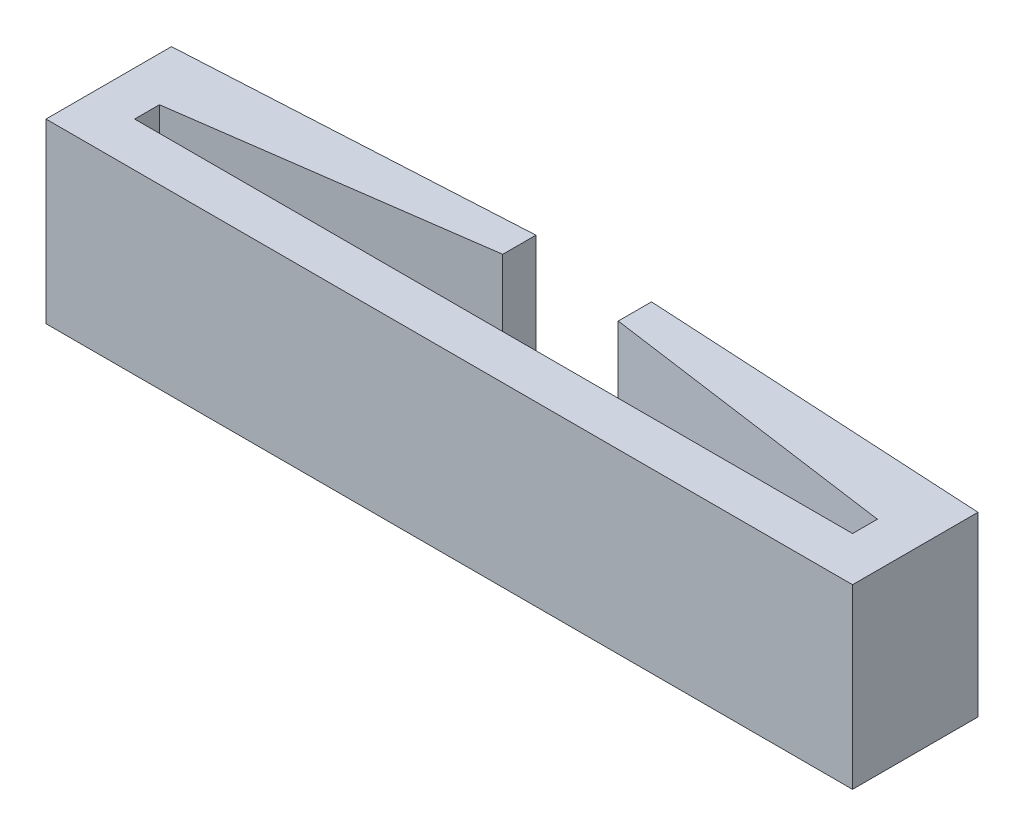
ISO-10303-21;
HEADER;
FILE_DESCRIPTION(('STEP AP214'),'2;1');
FILE_NAME('part.step','',(''),(''),'','','');
FILE_SCHEMA(('AUTOMOTIVE_DESIGN { 1 0 10303 214 1 1 1 1 }'));
ENDSEC;
DATA;
#1=APPLICATION_CONTEXT('core data for automotive mechanical design processes');
#2=APPLICATION_PROTOCOL_DEFINITION('international standard','automotive_design',2000,#1);
#3=PRODUCT_CONTEXT('',#1,'mechanical');
#4=PRODUCT('Part','Part','',(#3));
#5=PRODUCT_RELATED_PRODUCT_CATEGORY('part','',(#4));
#6=PRODUCT_DEFINITION_FORMATION('','',#4);
#7=PRODUCT_DEFINITION_CONTEXT('part definition',#1,'design');
#8=PRODUCT_DEFINITION('design','',#6,#7);
#9=PRODUCT_DEFINITION_SHAPE('','',#8);
#10=(LENGTH_UNIT() NAMED_UNIT(*) SI_UNIT(.MILLI.,.METRE.));
#11=(NAMED_UNIT(*) PLANE_ANGLE_UNIT() SI_UNIT($,.RADIAN.));
#12=(NAMED_UNIT(*) SI_UNIT($,.STERADIAN.) SOLID_ANGLE_UNIT());
#13=UNCERTAINTY_MEASURE_WITH_UNIT(LENGTH_MEASURE(1.E-05),#10,'distance_accuracy_value','');
#14=(GEOMETRIC_REPRESENTATION_CONTEXT(3) GLOBAL_UNCERTAINTY_ASSIGNED_CONTEXT((#13)) GLOBAL_UNIT_ASSIGNED_CONTEXT((#10,
#11,#12)) REPRESENTATION_CONTEXT('',''));
#15=CARTESIAN_POINT('',(0.,0.,0.));
#16=DIRECTION('',(0.,0.,1.));
#17=DIRECTION('',(1.,0.,0.));
#18=AXIS2_PLACEMENT_3D('',#15,#16,#17);
#19=CARTESIAN_POINT('',(40.4999999999978,-9.9999999713932,-5.46356580898595E-06));
#20=DIRECTION('',(-1.,0.,-1.95770992707561E-13));
#21=DIRECTION('',(-1.95770992707561E-13,0.,1.));
#22=AXIS2_PLACEMENT_3D('',#19,#20,#21);
#23=PLANE('',#22);
#24=CARTESIAN_POINT('',(40.4999999999978,28.6493442492265,-9.4580376516773E-13));
#25=DIRECTION('',(-1.,0.,-1.95770992707561E-13));
#26=DIRECTION('',(0.,-0.999847695156391,-0.0174524064372772));
#27=AXIS2_PLACEMENT_3D('',#24,#25,#26);
#28=ELLIPSE('',#27,28.6537070186987,0.5);
#29=CARTESIAN_POINT('',(40.4999999999978,8.38795720706216,-5.46356580898595E-06));
#30=VERTEX_POINT('',#29);
#31=CARTESIAN_POINT('',(40.4999999999978,2.53081651982366E-13,-0.499923847578205));
#32=VERTEX_POINT('',#31);
#33=EDGE_CURVE('E252',#30,#32,#28,.F.);
#34=ORIENTED_EDGE('',*,*,#33,.F.);
#35=DIRECTION('',(0.,1.,0.));
#36=VECTOR('',#35,1.);
#37=CARTESIAN_POINT('',(40.4999999999978,-9.9999999713932,-5.46356580898595E-06));
#38=LINE('',#37,#36);
#39=CARTESIAN_POINT('',(40.4999999999978,10.,-5.46356580898595E-06));
#40=VERTEX_POINT('',#39);
#41=EDGE_CURVE('E136',#30,#40,#38,.T.);
#42=ORIENTED_EDGE('',*,*,#41,.T.);
#43=DIRECTION('',(-1.95770992707561E-13,0.,1.));
#44=VECTOR('',#43,1.);
#45=CARTESIAN_POINT('',(40.4999999999978,10.,-5.46356580898595E-06));
#46=LINE('',#45,#44);
#47=CARTESIAN_POINT('',(40.4999999999983,10.,-2.80007615242175));
#48=VERTEX_POINT('',#47);
#49=EDGE_CURVE('E184',#48,#40,#46,.T.);
#50=ORIENTED_EDGE('',*,*,#49,.F.);
#51=DIRECTION('',(0.,1.,0.));
#52=VECTOR('',#51,1.);
#53=CARTESIAN_POINT('',(40.4999999999983,-9.9999999713932,-2.80007615242175));
#54=LINE('',#53,#52);
#55=CARTESIAN_POINT('',(40.4999999999983,-9.9999999713932,-2.80007615242175));
#56=VERTEX_POINT('',#55);
#57=EDGE_CURVE('E150',#56,#48,#54,.T.);
#58=ORIENTED_EDGE('',*,*,#57,.F.);
#59=DIRECTION('',(-1.95770992707561E-13,0.,1.));
#60=VECTOR('',#59,1.);
#61=CARTESIAN_POINT('',(40.4999999999978,-9.9999999713932,-5.46356580898595E-06));
#62=LINE('',#61,#60);
#63=CARTESIAN_POINT('',(40.4999999999978,-9.9999999713932,-5.46356580898595E-06));
#64=VERTEX_POINT('',#63);
#65=EDGE_CURVE('E143',#56,#64,#62,.T.);
#66=ORIENTED_EDGE('',*,*,#65,.T.);
#67=CARTESIAN_POINT('',(40.4999999999978,-8.38795720706217,-5.46356580898595E-06));
#68=VERTEX_POINT('',#67);
#69=EDGE_CURVE('E127',#64,#68,#38,.T.);
#70=ORIENTED_EDGE('',*,*,#69,.T.);
#71=CARTESIAN_POINT('',(40.4999999999978,-28.6493442492265,-9.4580376516773E-13));
#72=DIRECTION('',(-1.,0.,-1.95770992707561E-13));
#73=DIRECTION('',(0.,-0.999847695156391,0.0174524064372772));
#74=AXIS2_PLACEMENT_3D('',#71,#72,#73);
#75=ELLIPSE('',#74,28.6537070186987,0.5);
#76=EDGE_CURVE('E250',#32,#68,#75,.F.);
#77=ORIENTED_EDGE('',*,*,#76,.F.);
#78=EDGE_LOOP('',(#34,#42,#50,#58,#66,#70,#77));
#79=FACE_BOUND('',#78,.T.);
#80=ADVANCED_FACE('F16',(#79),#23,.T.);
#81=CARTESIAN_POINT('',(-40.4999999999978,-9.9999999713932,-2.800076152422));
#82=DIRECTION('',(1.,0.,1.98248717309288E-13));
#83=DIRECTION('',(1.98248717309288E-13,0.,-1.));
#84=AXIS2_PLACEMENT_3D('',#81,#82,#83);
#85=PLANE('',#84);
#86=CARTESIAN_POINT('',(-40.4999999999984,28.6493442492639,-2.9354773820045E-13));
#87=DIRECTION('',(1.,0.,1.98248717309288E-13));
#88=DIRECTION('',(0.,-0.999847695156391,-0.0174524064372841));
#89=AXIS2_PLACEMENT_3D('',#86,#87,#88);
#90=ELLIPSE('',#89,28.65370701871,0.5);
#91=CARTESIAN_POINT('',(-40.4999999999983,-2.58313986502162E-11,-0.499923847578205));
#92=VERTEX_POINT('',#91);
#93=CARTESIAN_POINT('',(-40.4999999999984,8.38811468213971,3.39300519291982E-08));
#94=VERTEX_POINT('',#93);
#95=EDGE_CURVE('E239',#92,#94,#90,.F.);
#96=ORIENTED_EDGE('',*,*,#95,.F.);
#97=CARTESIAN_POINT('',(-40.4999999999984,-28.6493442492639,-2.9354773820045E-13));
#98=DIRECTION('',(1.,0.,1.98248717309288E-13));
#99=DIRECTION('',(0.,-0.999847695156391,0.0174524064372841));
#100=AXIS2_PLACEMENT_3D('',#97,#98,#99);
#101=ELLIPSE('',#100,28.65370701871,0.5);
#102=CARTESIAN_POINT('',(-40.4999999999984,-8.38811468213971,3.39300519291982E-08));
#103=VERTEX_POINT('',#102);
#104=EDGE_CURVE('E217',#103,#92,#101,.F.);
#105=ORIENTED_EDGE('',*,*,#104,.F.);
#106=DIRECTION('',(0.,1.,0.));
#107=VECTOR('',#106,1.);
#108=CARTESIAN_POINT('',(-40.4999999999984,-9.9999999713932,3.39300519291982E-08));
#109=LINE('',#108,#107);
#110=CARTESIAN_POINT('',(-40.4999999999984,-9.9999999713932,3.39300519291982E-08));
#111=VERTEX_POINT('',#110);
#112=EDGE_CURVE('E38',#111,#103,#109,.T.);
#113=ORIENTED_EDGE('',*,*,#112,.F.);
#114=DIRECTION('',(1.98248717309288E-13,0.,-1.));
#115=VECTOR('',#114,1.);
#116=CARTESIAN_POINT('',(-40.4999999999978,-9.9999999713932,-2.800076152422));
#117=LINE('',#116,#115);
#118=CARTESIAN_POINT('',(-40.4999999999978,-9.9999999713932,-2.800076152422));
#119=VERTEX_POINT('',#118);
#120=EDGE_CURVE('E147',#111,#119,#117,.T.);
#121=ORIENTED_EDGE('',*,*,#120,.T.);
#122=DIRECTION('',(0.,1.,0.));
#123=VECTOR('',#122,1.);
#124=CARTESIAN_POINT('',(-40.4999999999978,-9.9999999713932,-2.800076152422));
#125=LINE('',#124,#123);
#126=CARTESIAN_POINT('',(-40.4999999999978,10.,-2.800076152422));
#127=VERTEX_POINT('',#126);
#128=EDGE_CURVE('E234',#119,#127,#125,.T.);
#129=ORIENTED_EDGE('',*,*,#128,.T.);
#130=DIRECTION('',(1.98248717309288E-13,0.,-1.));
#131=VECTOR('',#130,1.);
#132=CARTESIAN_POINT('',(-40.4999999999978,10.,-2.800076152422));
#133=LINE('',#132,#131);
#134=CARTESIAN_POINT('',(-40.4999999999984,10.,3.39300519291982E-08));
#135=VERTEX_POINT('',#134);
#136=EDGE_CURVE('E190',#135,#127,#133,.T.);
#137=ORIENTED_EDGE('',*,*,#136,.F.);
#138=EDGE_CURVE('E135',#94,#135,#109,.T.);
#139=ORIENTED_EDGE('',*,*,#138,.F.);
#140=EDGE_LOOP('',(#96,#105,#113,#121,#129,#137,#139));
#141=FACE_BOUND('',#140,.T.);
#142=ADVANCED_FACE('F298',(#141),#85,.T.);
#143=CARTESIAN_POINT('',(40.4999999999983,-9.9999999713932,-2.80007615242175));
#144=DIRECTION('',(-0.138376222382661,0.,0.990379735797893));
#145=DIRECTION('',(0.990379735797893,0.,0.138376222382661));
#146=AXIS2_PLACEMENT_3D('',#143,#144,#145);
#147=PLANE('',#146);
#148=DIRECTION('',(0.990379735797893,0.,0.138376222382661));
#149=VECTOR('',#148,1.);
#150=CARTESIAN_POINT('',(40.4999999999983,10.,-2.80007615242175));
#151=LINE('',#150,#149);
#152=CARTESIAN_POINT('',(6.51680452782488,10.,-7.5482207720634));
#153=VERTEX_POINT('',#152);
#154=EDGE_CURVE('E151',#153,#48,#151,.T.);
#155=ORIENTED_EDGE('',*,*,#154,.F.);
#156=DIRECTION('',(0.,1.,0.));
#157=VECTOR('',#156,1.);
#158=CARTESIAN_POINT('',(6.51680452782488,-9.9999999713932,-7.5482207720634));
#159=LINE('',#158,#157);
#160=CARTESIAN_POINT('',(6.51680452782488,-9.9999999713932,-7.5482207720634));
#161=VERTEX_POINT('',#160);
#162=EDGE_CURVE('E218',#161,#153,#159,.T.);
#163=ORIENTED_EDGE('',*,*,#162,.F.);
#164=DIRECTION('',(0.990379735797893,0.,0.138376222382661));
#165=VECTOR('',#164,1.);
#166=CARTESIAN_POINT('',(40.4999999999983,-9.9999999713932,-2.80007615242175));
#167=LINE('',#166,#165);
#168=EDGE_CURVE('E182',#161,#56,#167,.T.);
#169=ORIENTED_EDGE('',*,*,#168,.T.);
#170=ORIENTED_EDGE('',*,*,#57,.T.);
#171=EDGE_LOOP('',(#155,#163,#169,#170));
#172=FACE_BOUND('',#171,.T.);
#173=ADVANCED_FACE('F267',(#172),#147,.T.);
#174=CARTESIAN_POINT('',(6.51680452782488,-9.9999999713932,-7.5482207720634));
#175=DIRECTION('',(-1.,0.,0.));
#176=DIRECTION('',(0.,0.,1.));
#177=AXIS2_PLACEMENT_3D('',#174,#175,#176);
#178=PLANE('',#177);
#179=DIRECTION('',(0.,0.,1.));
#180=VECTOR('',#179,1.);
#181=CARTESIAN_POINT('',(6.51680452782488,10.,-7.5482207720634));
#182=LINE('',#181,#180);
#183=CARTESIAN_POINT('',(6.51680452782488,10.,-11.2970748564441));
#184=VERTEX_POINT('',#183);
#185=EDGE_CURVE('E154',#184,#153,#182,.T.);
#186=ORIENTED_EDGE('',*,*,#185,.F.);
#187=DIRECTION('',(0.,1.,0.));
#188=VECTOR('',#187,1.);
#189=CARTESIAN_POINT('',(6.51680452782488,-9.9999999713932,-11.2970748564441));
#190=LINE('',#189,#188);
#191=CARTESIAN_POINT('',(6.51680452782488,-9.9999999713932,-11.2970748564441));
#192=VERTEX_POINT('',#191);
#193=EDGE_CURVE('E220',#192,#184,#190,.T.);
#194=ORIENTED_EDGE('',*,*,#193,.F.);
#195=DIRECTION('',(0.,0.,1.));
#196=VECTOR('',#195,1.);
#197=CARTESIAN_POINT('',(6.51680452782488,-9.9999999713932,-7.5482207720634));
#198=LINE('',#197,#196);
#199=EDGE_CURVE('E179',#192,#161,#198,.T.);
#200=ORIENTED_EDGE('',*,*,#199,.T.);
#201=ORIENTED_EDGE('',*,*,#162,.T.);
#202=EDGE_LOOP('',(#186,#194,#200,#201));
#203=FACE_BOUND('',#202,.T.);
#204=ADVANCED_FACE('F431',(#203),#178,.T.);
#205=CARTESIAN_POINT('',(6.51680452782488,-9.9999999713932,-11.2970748564441));
#206=DIRECTION('',(0.0548674959499856,0.,-0.998493644390478));
#207=DIRECTION('',(-0.998493644390478,0.,-0.0548674959499857));
#208=AXIS2_PLACEMENT_3D('',#205,#206,#207);
#209=PLANE('',#208);
#210=DIRECTION('',(-0.998493644390478,0.,-0.0548674959499856));
#211=VECTOR('',#210,1.);
#212=CARTESIAN_POINT('',(6.51680452782488,10.,-11.2970748564441));
#213=LINE('',#212,#211);
#214=CARTESIAN_POINT('',(45.5000000000027,10.,-9.15493771645967));
#215=VERTEX_POINT('',#214);
#216=EDGE_CURVE('E211',#215,#184,#213,.T.);
#217=ORIENTED_EDGE('',*,*,#216,.F.);
#218=DIRECTION('',(0.,1.,0.));
#219=VECTOR('',#218,1.);
#220=CARTESIAN_POINT('',(45.5000000000027,-9.9999999713932,-9.15493771645967));
#221=LINE('',#220,#219);
#222=CARTESIAN_POINT('',(45.5000000000027,-9.9999999713932,-9.15493771645967));
#223=VERTEX_POINT('',#222);
#224=EDGE_CURVE('E222',#223,#215,#221,.T.);
#225=ORIENTED_EDGE('',*,*,#224,.F.);
#226=DIRECTION('',(-0.998493644390478,0.,-0.0548674959499856));
#227=VECTOR('',#226,1.);
#228=CARTESIAN_POINT('',(6.51680452782488,-9.9999999713932,-11.2970748564441));
#229=LINE('',#228,#227);
#230=EDGE_CURVE('E176',#223,#192,#229,.T.);
#231=ORIENTED_EDGE('',*,*,#230,.T.);
#232=ORIENTED_EDGE('',*,*,#193,.T.);
#233=EDGE_LOOP('',(#217,#225,#231,#232));
#234=FACE_BOUND('',#233,.T.);
#235=ADVANCED_FACE('F274',(#234),#209,.T.);
#236=CARTESIAN_POINT('',(45.5000000000027,-9.9999999713932,-9.15493771645967));
#237=DIRECTION('',(1.,0.,0.));
#238=DIRECTION('',(0.,0.,-1.));
#239=AXIS2_PLACEMENT_3D('',#236,#237,#238);
#240=PLANE('',#239);
#241=DIRECTION('',(0.,0.,-1.));
#242=VECTOR('',#241,1.);
#243=CARTESIAN_POINT('',(45.5000000000027,10.,-9.15493771645967));
#244=LINE('',#243,#242);
#245=CARTESIAN_POINT('',(45.5000000000028,10.,5.));
#246=VERTEX_POINT('',#245);
#247=EDGE_CURVE('E208',#246,#215,#244,.T.);
#248=ORIENTED_EDGE('',*,*,#247,.F.);
#249=DIRECTION('',(0.,1.,0.));
#250=VECTOR('',#249,1.);
#251=CARTESIAN_POINT('',(45.5000000000028,-9.9999999713932,5.));
#252=LINE('',#251,#250);
#253=CARTESIAN_POINT('',(45.5000000000028,-9.9999999713932,5.));
#254=VERTEX_POINT('',#253);
#255=EDGE_CURVE('E224',#254,#246,#252,.T.);
#256=ORIENTED_EDGE('',*,*,#255,.F.);
#257=DIRECTION('',(0.,0.,-1.));
#258=VECTOR('',#257,1.);
#259=CARTESIAN_POINT('',(45.5000000000027,-9.9999999713932,-9.15493771645967));
#260=LINE('',#259,#258);
#261=EDGE_CURVE('E173',#254,#223,#260,.T.);
#262=ORIENTED_EDGE('',*,*,#261,.T.);
#263=ORIENTED_EDGE('',*,*,#224,.T.);
#264=EDGE_LOOP('',(#248,#256,#262,#263));
#265=FACE_BOUND('',#264,.T.);
#266=ADVANCED_FACE('F277',(#265),#240,.T.);
#267=CARTESIAN_POINT('',(45.5000000000028,-9.9999999713932,5.));
#268=DIRECTION('',(0.,0.,1.));
#269=DIRECTION('',(1.,0.,0.));
#270=AXIS2_PLACEMENT_3D('',#267,#268,#269);
#271=PLANE('',#270);
#272=DIRECTION('',(1.,0.,0.));
#273=VECTOR('',#272,1.);
#274=CARTESIAN_POINT('',(45.5000000000028,10.,5.));
#275=LINE('',#274,#273);
#276=CARTESIAN_POINT('',(-45.5000000000031,10.,5.));
#277=VERTEX_POINT('',#276);
#278=EDGE_CURVE('E205',#277,#246,#275,.T.);
#279=ORIENTED_EDGE('',*,*,#278,.F.);
#280=DIRECTION('',(0.,1.,0.));
#281=VECTOR('',#280,1.);
#282=CARTESIAN_POINT('',(-45.5000000000031,-9.9999999713932,5.));
#283=LINE('',#282,#281);
#284=CARTESIAN_POINT('',(-45.5000000000031,-9.9999999713932,5.));
#285=VERTEX_POINT('',#284);
#286=EDGE_CURVE('E226',#285,#277,#283,.T.);
#287=ORIENTED_EDGE('',*,*,#286,.F.);
#288=DIRECTION('',(1.,0.,0.));
#289=VECTOR('',#288,1.);
#290=CARTESIAN_POINT('',(45.5000000000028,-9.9999999713932,5.));
#291=LINE('',#290,#289);
#292=EDGE_CURVE('E170',#285,#254,#291,.T.);
#293=ORIENTED_EDGE('',*,*,#292,.T.);
#294=ORIENTED_EDGE('',*,*,#255,.T.);
#295=EDGE_LOOP('',(#279,#287,#293,#294));
#296=FACE_BOUND('',#295,.T.);
#297=ADVANCED_FACE('F282',(#296),#271,.T.);
#298=CARTESIAN_POINT('',(-45.5000000000031,-9.9999999713932,5.));
#299=DIRECTION('',(-1.,0.,0.));
#300=DIRECTION('',(0.,0.,1.));
#301=AXIS2_PLACEMENT_3D('',#298,#299,#300);
#302=PLANE('',#301);
#303=DIRECTION('',(0.,0.,1.));
#304=VECTOR('',#303,1.);
#305=CARTESIAN_POINT('',(-45.5000000000031,10.,5.));
#306=LINE('',#305,#304);
#307=CARTESIAN_POINT('',(-45.5000000000022,10.,-9.1549377164597));
#308=VERTEX_POINT('',#307);
#309=EDGE_CURVE('E202',#308,#277,#306,.T.);
#310=ORIENTED_EDGE('',*,*,#309,.F.);
#311=DIRECTION('',(0.,1.,0.));
#312=VECTOR('',#311,1.);
#313=CARTESIAN_POINT('',(-45.5000000000022,-9.9999999713932,-9.1549377164597));
#314=LINE('',#313,#312);
#315=CARTESIAN_POINT('',(-45.5000000000022,-9.9999999713932,-9.1549377164597));
#316=VERTEX_POINT('',#315);
#317=EDGE_CURVE('E228',#316,#308,#314,.T.);
#318=ORIENTED_EDGE('',*,*,#317,.F.);
#319=DIRECTION('',(0.,0.,1.));
#320=VECTOR('',#319,1.);
#321=CARTESIAN_POINT('',(-45.5000000000031,-9.9999999713932,5.));
#322=LINE('',#321,#320);
#323=EDGE_CURVE('E167',#316,#285,#322,.T.);
#324=ORIENTED_EDGE('',*,*,#323,.T.);
#325=ORIENTED_EDGE('',*,*,#286,.T.);
#326=EDGE_LOOP('',(#310,#318,#324,#325));
#327=FACE_BOUND('',#326,.T.);
#328=ADVANCED_FACE('F285',(#327),#302,.T.);
#329=CARTESIAN_POINT('',(-6.51680452782488,-9.9999999713932,-11.2970748564441));
#330=DIRECTION('',(-0.0548674959499857,0.,-0.998493644390478));
#331=DIRECTION('',(-0.998493644390478,0.,0.0548674959499857));
#332=AXIS2_PLACEMENT_3D('',#329,#330,#331);
#333=PLANE('',#332);
#334=DIRECTION('',(-0.998493644390478,0.,0.0548674959499857));
#335=VECTOR('',#334,1.);
#336=CARTESIAN_POINT('',(-6.51680452782488,10.,-11.2970748564441));
#337=LINE('',#336,#335);
#338=CARTESIAN_POINT('',(-6.51680452782488,10.,-11.2970748564441));
#339=VERTEX_POINT('',#338);
#340=EDGE_CURVE('E199',#339,#308,#337,.T.);
#341=ORIENTED_EDGE('',*,*,#340,.F.);
#342=DIRECTION('',(0.,1.,0.));
#343=VECTOR('',#342,1.);
#344=CARTESIAN_POINT('',(-6.51680452782488,-9.9999999713932,-11.2970748564441));
#345=LINE('',#344,#343);
#346=CARTESIAN_POINT('',(-6.51680452782488,-9.9999999713932,-11.2970748564441));
#347=VERTEX_POINT('',#346);
#348=EDGE_CURVE('E230',#347,#339,#345,.T.);
#349=ORIENTED_EDGE('',*,*,#348,.F.);
#350=DIRECTION('',(-0.998493644390478,0.,0.0548674959499857));
#351=VECTOR('',#350,1.);
#352=CARTESIAN_POINT('',(-6.51680452782488,-9.9999999713932,-11.2970748564441));
#353=LINE('',#352,#351);
#354=EDGE_CURVE('E164',#347,#316,#353,.T.);
#355=ORIENTED_EDGE('',*,*,#354,.T.);
#356=ORIENTED_EDGE('',*,*,#317,.T.);
#357=EDGE_LOOP('',(#341,#349,#355,#356));
#358=FACE_BOUND('',#357,.T.);
#359=ADVANCED_FACE('F290',(#358),#333,.T.);
#360=CARTESIAN_POINT('',(-6.51680452782488,-9.9999999713932,-7.5482207720634));
#361=DIRECTION('',(1.,0.,0.));
#362=DIRECTION('',(0.,0.,-1.));
#363=AXIS2_PLACEMENT_3D('',#360,#361,#362);
#364=PLANE('',#363);
#365=DIRECTION('',(0.,0.,-1.));
#366=VECTOR('',#365,1.);
#367=CARTESIAN_POINT('',(-6.51680452782488,10.,-7.5482207720634));
#368=LINE('',#367,#366);
#369=CARTESIAN_POINT('',(-6.51680452782488,10.,-7.5482207720634));
#370=VERTEX_POINT('',#369);
#371=EDGE_CURVE('E196',#370,#339,#368,.T.);
#372=ORIENTED_EDGE('',*,*,#371,.F.);
#373=DIRECTION('',(0.,1.,0.));
#374=VECTOR('',#373,1.);
#375=CARTESIAN_POINT('',(-6.51680452782488,-9.9999999713932,-7.5482207720634));
#376=LINE('',#375,#374);
#377=CARTESIAN_POINT('',(-6.51680452782488,-9.9999999713932,-7.5482207720634));
#378=VERTEX_POINT('',#377);
#379=EDGE_CURVE('E232',#378,#370,#376,.T.);
#380=ORIENTED_EDGE('',*,*,#379,.F.);
#381=DIRECTION('',(0.,0.,-1.));
#382=VECTOR('',#381,1.);
#383=CARTESIAN_POINT('',(-6.51680452782488,-9.9999999713932,-7.5482207720634));
#384=LINE('',#383,#382);
#385=EDGE_CURVE('E161',#378,#347,#384,.T.);
#386=ORIENTED_EDGE('',*,*,#385,.T.);
#387=ORIENTED_EDGE('',*,*,#348,.T.);
#388=EDGE_LOOP('',(#372,#380,#386,#387));
#389=FACE_BOUND('',#388,.T.);
#390=ADVANCED_FACE('F293',(#389),#364,.T.);
#391=CARTESIAN_POINT('',(-40.4999999999978,-9.9999999713932,-2.800076152422));
#392=DIRECTION('',(0.138376222382655,0.,0.990379735797894));
#393=DIRECTION('',(0.990379735797894,0.,-0.138376222382655));
#394=AXIS2_PLACEMENT_3D('',#391,#392,#393);
#395=PLANE('',#394);
#396=DIRECTION('',(0.990379735797894,0.,-0.138376222382655));
#397=VECTOR('',#396,1.);
#398=CARTESIAN_POINT('',(-40.4999999999978,10.,-2.800076152422));
#399=LINE('',#398,#397);
#400=EDGE_CURVE('E193',#127,#370,#399,.T.);
#401=ORIENTED_EDGE('',*,*,#400,.F.);
#402=ORIENTED_EDGE('',*,*,#128,.F.);
#403=DIRECTION('',(0.990379735797894,0.,-0.138376222382655));
#404=VECTOR('',#403,1.);
#405=CARTESIAN_POINT('',(-40.4999999999978,-9.9999999713932,-2.800076152422));
#406=LINE('',#405,#404);
#407=EDGE_CURVE('E158',#119,#378,#406,.T.);
#408=ORIENTED_EDGE('',*,*,#407,.T.);
#409=ORIENTED_EDGE('',*,*,#379,.T.);
#410=EDGE_LOOP('',(#401,#402,#408,#409));
#411=FACE_BOUND('',#410,.T.);
#412=ADVANCED_FACE('F296',(#411),#395,.T.);
#413=CARTESIAN_POINT('',(0.,-10.,0.));
#414=DIRECTION('',(0.,1.,0.));
#415=DIRECTION('',(0.,0.,1.));
#416=AXIS2_PLACEMENT_3D('',#413,#414,#415);
#417=PLANE('',#416);
#418=ORIENTED_EDGE('',*,*,#65,.F.);
#419=ORIENTED_EDGE('',*,*,#168,.F.);
#420=ORIENTED_EDGE('',*,*,#199,.F.);
#421=ORIENTED_EDGE('',*,*,#230,.F.);
#422=ORIENTED_EDGE('',*,*,#261,.F.);
#423=ORIENTED_EDGE('',*,*,#292,.F.);
#424=ORIENTED_EDGE('',*,*,#323,.F.);
#425=ORIENTED_EDGE('',*,*,#354,.F.);
#426=ORIENTED_EDGE('',*,*,#385,.F.);
#427=ORIENTED_EDGE('',*,*,#407,.F.);
#428=ORIENTED_EDGE('',*,*,#120,.F.);
#429=DIRECTION('',(-1.,0.,6.78703192705605E-08));
#430=VECTOR('',#429,1.);
#431=CARTESIAN_POINT('',(-40.4999999999984,-9.9999999713932,3.39300519291982E-08));
#432=LINE('',#431,#430);
#433=EDGE_CURVE('E130',#64,#111,#432,.T.);
#434=ORIENTED_EDGE('',*,*,#433,.F.);
#435=EDGE_LOOP('',(#418,#419,#420,#421,#422,#423,#424,#425,#426,#427,#428,#434));
#436=FACE_BOUND('',#435,.T.);
#437=ADVANCED_FACE('F141',(#436),#417,.F.);
#438=CARTESIAN_POINT('',(0.,10.,0.));
#439=DIRECTION('',(0.,1.,0.));
#440=DIRECTION('',(0.,0.,1.));
#441=AXIS2_PLACEMENT_3D('',#438,#439,#440);
#442=PLANE('',#441);
#443=ORIENTED_EDGE('',*,*,#49,.T.);
#444=DIRECTION('',(-1.,0.,6.78703192705605E-08));
#445=VECTOR('',#444,1.);
#446=CARTESIAN_POINT('',(-40.4999999999984,10.,3.39300519291982E-08));
#447=LINE('',#446,#445);
#448=EDGE_CURVE('E187',#40,#135,#447,.T.);
#449=ORIENTED_EDGE('',*,*,#448,.T.);
#450=ORIENTED_EDGE('',*,*,#136,.T.);
#451=ORIENTED_EDGE('',*,*,#400,.T.);
#452=ORIENTED_EDGE('',*,*,#371,.T.);
#453=ORIENTED_EDGE('',*,*,#340,.T.);
#454=ORIENTED_EDGE('',*,*,#309,.T.);
#455=ORIENTED_EDGE('',*,*,#278,.T.);
#456=ORIENTED_EDGE('',*,*,#247,.T.);
#457=ORIENTED_EDGE('',*,*,#216,.T.);
#458=ORIENTED_EDGE('',*,*,#185,.T.);
#459=ORIENTED_EDGE('',*,*,#154,.T.);
#460=EDGE_LOOP('',(#443,#449,#450,#451,#452,#453,#454,#455,#456,#457,#458,#459));
#461=FACE_BOUND('',#460,.T.);
#462=ADVANCED_FACE('F263',(#461),#442,.T.);
#463=CARTESIAN_POINT('',(-40.1773549408,-10.16502118743,-0.3226450591987));
#464=DIRECTION('',(-0.0174497491606798,-0.999695459881888,0.0174497491606798));
#465=DIRECTION('',(0.,-0.0174524064372806,-0.999847695156391));
#466=AXIS2_PLACEMENT_3D('',#463,#464,#465);
#467=CYLINDRICAL_SURFACE('',#466,0.5);
#468=CARTESIAN_POINT('',(-40.5000000339287,-28.6493461931322,3.39300542957083E-08));
#469=DIRECTION('',(-6.78703192705605E-08,0.,-1.));
#470=DIRECTION('',(-0.0174524076214201,-0.999847695135722,1.18450047730575E-09));
#471=AXIS2_PLACEMENT_3D('',#468,#469,#470);
#472=ELLIPSE('',#471,28.6537089634407,0.5);
#473=CARTESIAN_POINT('',(-40.00007615242,0.,0.));
#474=VERTEX_POINT('',#473);
#475=EDGE_CURVE('E242',#474,#103,#472,.F.);
#476=ORIENTED_EDGE('',*,*,#475,.T.);
#477=ORIENTED_EDGE('',*,*,#104,.T.);
#478=CARTESIAN_POINT('',(-39.9999238359767,-1.5178830414797E-12,-0.500076164021969));
#479=DIRECTION('',(0.,-1.,0.));
#480=DIRECTION('',(0.707106781186548,0.,-0.707106781186548));
#481=AXIS2_PLACEMENT_3D('',#478,#479,#480);
#482=ELLIPSE('',#481,0.500152316445525,0.5);
#483=EDGE_CURVE('E11',#474,#92,#482,.T.);
#484=ORIENTED_EDGE('',*,*,#483,.F.);
#485=EDGE_LOOP('',(#476,#477,#484));
#486=FACE_BOUND('',#485,.T.);
#487=ADVANCED_FACE('F301',(#486),#467,.F.);
#488=CARTESIAN_POINT('',(-40.1773549408,10.16502118743,-0.3226450591987));
#489=DIRECTION('',(0.0174497491606798,-0.999695459881888,-0.0174497491606798));
#490=DIRECTION('',(0.,0.0174524064372806,-0.999847695156391));
#491=AXIS2_PLACEMENT_3D('',#488,#489,#490);
#492=CYLINDRICAL_SURFACE('',#491,0.5);
#493=ORIENTED_EDGE('',*,*,#483,.T.);
#494=ORIENTED_EDGE('',*,*,#95,.T.);
#495=CARTESIAN_POINT('',(-40.5000000339287,28.6493461931322,3.39300542957083E-08));
#496=DIRECTION('',(-6.78703192705605E-08,0.,-1.));
#497=DIRECTION('',(0.0174524076214201,-0.999847695135722,-1.18450047730575E-09));
#498=AXIS2_PLACEMENT_3D('',#495,#496,#497);
#499=ELLIPSE('',#498,28.6537089634407,0.5);
#500=EDGE_CURVE('E245',#94,#474,#499,.F.);
#501=ORIENTED_EDGE('',*,*,#500,.T.);
#502=EDGE_LOOP('',(#493,#494,#501));
#503=FACE_BOUND('',#502,.T.);
#504=ADVANCED_FACE('F303',(#503),#492,.F.);
#505=CARTESIAN_POINT('',(40.1773549408,-10.16502118743,-0.3226450591987));
#506=DIRECTION('',(0.0174497491606798,-0.999695459881888,0.0174497491606798));
#507=DIRECTION('',(0.,-0.0174524064372806,-0.999847695156391));
#508=AXIS2_PLACEMENT_3D('',#505,#506,#507);
#509=CYLINDRICAL_SURFACE('',#508,0.5);
#510=CARTESIAN_POINT('',(39.9999238359767,-1.5178830414797E-12,-0.500076164021969));
#511=DIRECTION('',(0.,-1.,0.));
#512=DIRECTION('',(-0.707106781186548,0.,-0.707106781186548));
#513=AXIS2_PLACEMENT_3D('',#510,#511,#512);
#514=ELLIPSE('',#513,0.500152316445525,0.5);
#515=CARTESIAN_POINT('',(40.0024065136359,-1.51506825835175E-12,-5.4297939803722E-06));
#516=VERTEX_POINT('',#515);
#517=EDGE_CURVE('E20',#32,#516,#514,.T.);
#518=ORIENTED_EDGE('',*,*,#517,.F.);
#519=ORIENTED_EDGE('',*,*,#76,.T.);
#520=CARTESIAN_POINT('',(40.4999945364332,-28.6490312418264,-5.46356543823035E-06));
#521=DIRECTION('',(-6.78703192705605E-08,0.,-1.));
#522=DIRECTION('',(0.0174524052531409,-0.999847695177061,-1.18450031656988E-09));
#523=AXIS2_PLACEMENT_3D('',#520,#521,#522);
#524=ELLIPSE('',#523,28.6537050739683,0.5);
#525=EDGE_CURVE('E131',#68,#516,#524,.F.);
#526=ORIENTED_EDGE('',*,*,#525,.T.);
#527=EDGE_LOOP('',(#518,#519,#526));
#528=FACE_BOUND('',#527,.T.);
#529=ADVANCED_FACE('F258',(#528),#509,.F.);
#530=CARTESIAN_POINT('',(40.1773549408,10.16502118743,-0.3226450591987));
#531=DIRECTION('',(-0.0174497491606798,-0.999695459881888,-0.0174497491606798));
#532=DIRECTION('',(0.,0.0174524064372806,-0.999847695156391));
#533=AXIS2_PLACEMENT_3D('',#530,#531,#532);
#534=CYLINDRICAL_SURFACE('',#533,0.5);
#535=CARTESIAN_POINT('',(40.4999945364332,28.6490312418264,-5.46356543823035E-06));
#536=DIRECTION('',(-6.78703192705605E-08,0.,-1.));
#537=DIRECTION('',(-0.0174524052531409,-0.999847695177061,1.18450031656988E-09));
#538=AXIS2_PLACEMENT_3D('',#535,#536,#537);
#539=ELLIPSE('',#538,28.6537050739683,0.5);
#540=EDGE_CURVE('E31',#516,#30,#539,.F.);
#541=ORIENTED_EDGE('',*,*,#540,.T.);
#542=ORIENTED_EDGE('',*,*,#33,.T.);
#543=ORIENTED_EDGE('',*,*,#517,.T.);
#544=EDGE_LOOP('',(#541,#542,#543));
#545=FACE_BOUND('',#544,.T.);
#546=ADVANCED_FACE('F18',(#545),#534,.F.);
#547=CARTESIAN_POINT('',(-21.9263573992119,-10.,-1.52986485719292E-06));
#548=DIRECTION('',(3.42075182845302E-08,0.,1.));
#549=DIRECTION('',(1.,0.,-3.42075182845302E-08));
#550=AXIS2_PLACEMENT_3D('',#547,#548,#549);
#551=PLANE('',#550);
#552=ORIENTED_EDGE('',*,*,#540,.F.);
#553=ORIENTED_EDGE('',*,*,#525,.F.);
#554=ORIENTED_EDGE('',*,*,#69,.F.);
#555=ORIENTED_EDGE('',*,*,#433,.T.);
#556=ORIENTED_EDGE('',*,*,#112,.T.);
#557=ORIENTED_EDGE('',*,*,#475,.F.);
#558=ORIENTED_EDGE('',*,*,#500,.F.);
#559=ORIENTED_EDGE('',*,*,#138,.T.);
#560=ORIENTED_EDGE('',*,*,#448,.F.);
#561=ORIENTED_EDGE('',*,*,#41,.F.);
#562=EDGE_LOOP('',(#552,#553,#554,#555,#556,#557,#558,#559,#560,#561));
#563=FACE_BOUND('',#562,.T.);
#564=ADVANCED_FACE('F129',(#563),#551,.F.);
#565=CLOSED_SHELL('',(#80,#142,#173,#204,#235,#266,#297,#328,#359,#390,#412,#437,#462,#487,#504,
#529,#546,#564));
#566=MANIFOLD_SOLID_BREP('B1',#565);
#567=ADVANCED_BREP_SHAPE_REPRESENTATION('',(#18,#566),#14);
#568=SHAPE_DEFINITION_REPRESENTATION(#9,#567);
ENDSEC;
END-ISO-10303-21;
